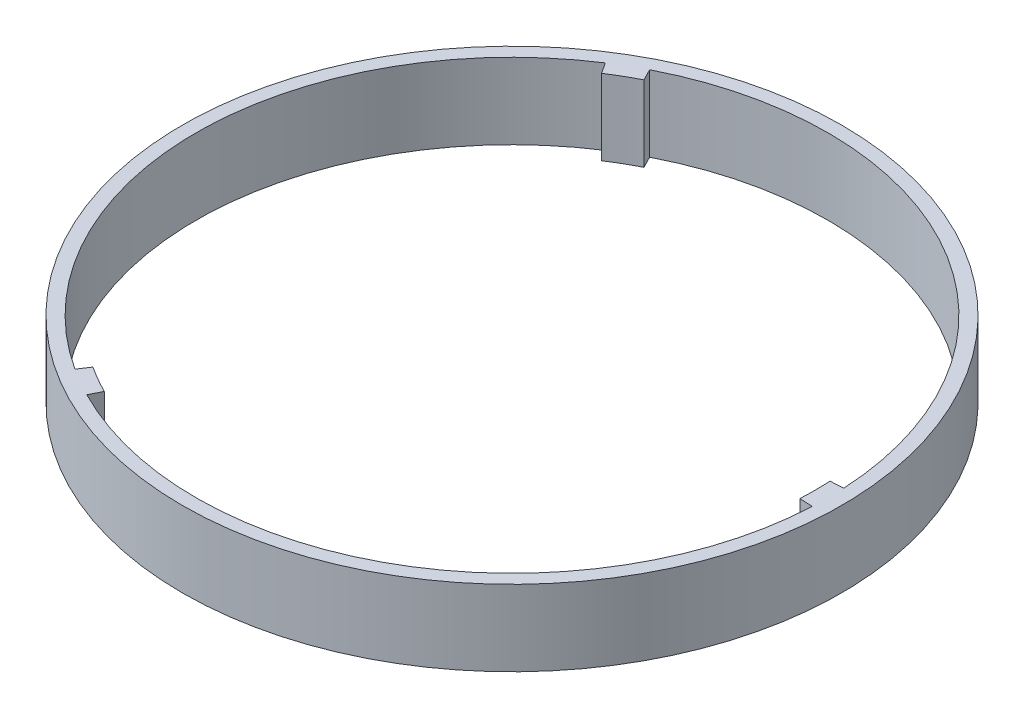
ISO-10303-21;
HEADER;
FILE_DESCRIPTION(('STEP AP214'),'2;1');
FILE_NAME('part.step','',(''),(''),'','','');
FILE_SCHEMA(('AUTOMOTIVE_DESIGN { 1 0 10303 214 1 1 1 1 }'));
ENDSEC;
DATA;
#1=APPLICATION_CONTEXT('core data for automotive mechanical design processes');
#2=APPLICATION_PROTOCOL_DEFINITION('international standard','automotive_design',2000,#1);
#3=PRODUCT_CONTEXT('',#1,'mechanical');
#4=PRODUCT('Part','Part','',(#3));
#5=PRODUCT_RELATED_PRODUCT_CATEGORY('part','',(#4));
#6=PRODUCT_DEFINITION_FORMATION('','',#4);
#7=PRODUCT_DEFINITION_CONTEXT('part definition',#1,'design');
#8=PRODUCT_DEFINITION('design','',#6,#7);
#9=PRODUCT_DEFINITION_SHAPE('','',#8);
#10=(LENGTH_UNIT() NAMED_UNIT(*) SI_UNIT(.MILLI.,.METRE.));
#11=(NAMED_UNIT(*) PLANE_ANGLE_UNIT() SI_UNIT($,.RADIAN.));
#12=(NAMED_UNIT(*) SI_UNIT($,.STERADIAN.) SOLID_ANGLE_UNIT());
#13=UNCERTAINTY_MEASURE_WITH_UNIT(LENGTH_MEASURE(1.E-05),#10,'distance_accuracy_value','');
#14=(GEOMETRIC_REPRESENTATION_CONTEXT(3) GLOBAL_UNCERTAINTY_ASSIGNED_CONTEXT((#13)) GLOBAL_UNIT_ASSIGNED_CONTEXT((#10,
#11,#12)) REPRESENTATION_CONTEXT('',''));
#15=CARTESIAN_POINT('',(0.,0.,0.));
#16=DIRECTION('',(0.,0.,1.));
#17=DIRECTION('',(1.,0.,0.));
#18=AXIS2_PLACEMENT_3D('',#15,#16,#17);
#19=CARTESIAN_POINT('',(-0.0197413031440411,19.05,-0.00227396375139646));
#20=DIRECTION('',(0.,1.,0.));
#21=DIRECTION('',(0.,0.,1.));
#22=AXIS2_PLACEMENT_3D('',#19,#20,#21);
#23=PLANE('',#22);
#24=CARTESIAN_POINT('',(-0.0197413031440411,19.05,-0.00227396375139646));
#25=DIRECTION('',(0.,1.,0.));
#26=DIRECTION('',(0.,0.,1.));
#27=AXIS2_PLACEMENT_3D('',#24,#25,#26);
#28=CIRCLE('',#27,55.245);
#29=CARTESIAN_POINT('',(-0.0197413031440411,19.05,55.2427260362486));
#30=VERTEX_POINT('',#29);
#31=EDGE_CURVE('E195',#30,#30,#28,.T.);
#32=ORIENTED_EDGE('',*,*,#31,.T.);
#33=EDGE_LOOP('',(#32));
#34=FACE_BOUND('',#33,.T.);
#35=CARTESIAN_POINT('',(-0.0197413031440411,19.05,-0.00227396375139646));
#36=DIRECTION('',(0.,1.,0.));
#37=DIRECTION('',(0.,0.,1.));
#38=AXIS2_PLACEMENT_3D('',#35,#36,#37);
#39=CIRCLE('',#38,50.8);
#40=CARTESIAN_POINT('',(-27.636409603673,19.05,42.6352638635969));
#41=VERTEX_POINT('',#40);
#42=CARTESIAN_POINT('',(-23.1365980238422,19.05,45.2332312877069));
#43=VERTEX_POINT('',#42);
#44=EDGE_CURVE('E189',#41,#43,#39,.T.);
#45=ORIENTED_EDGE('',*,*,#44,.F.);
#46=DIRECTION('',(-0.543635202766318,0.,0.839321610774573));
#47=VECTOR('',#46,1.);
#48=CARTESIAN_POINT('',(-27.636409603673,19.05,42.6352638635969));
#49=LINE('',#48,#47);
#50=CARTESIAN_POINT('',(-28.8204739876455,19.05,44.4633478819968));
#51=VERTEX_POINT('',#50);
#52=EDGE_CURVE('E137',#41,#51,#49,.T.);
#53=ORIENTED_EDGE('',*,*,#52,.T.);
#54=CARTESIAN_POINT('',(-0.0197413031440411,19.05,-0.00227396375139646));
#55=DIRECTION('',(0.,1.,0.));
#56=DIRECTION('',(0.,0.,1.));
#57=AXIS2_PLACEMENT_3D('',#54,#55,#56);
#58=CIRCLE('',#57,52.9780495044239);
#59=CARTESIAN_POINT('',(-28.8290868119656,19.05,-44.4623160312813));
#60=VERTEX_POINT('',#59);
#61=EDGE_CURVE('E165',#60,#51,#58,.T.);
#62=ORIENTED_EDGE('',*,*,#61,.F.);
#63=DIRECTION('',(-0.543797776217045,0.,-0.839216288319881));
#64=VECTOR('',#63,1.);
#65=CARTESIAN_POINT('',(-27.6446683349693,19.05,-42.6344614104017));
#66=LINE('',#65,#64);
#67=CARTESIAN_POINT('',(-27.6446683349693,19.05,-42.6344614104017));
#68=VERTEX_POINT('',#67);
#69=EDGE_CURVE('E162',#68,#60,#66,.T.);
#70=ORIENTED_EDGE('',*,*,#69,.F.);
#71=CARTESIAN_POINT('',(-23.1323747405168,19.05,-45.2399372056745));
#72=VERTEX_POINT('',#71);
#73=EDGE_CURVE('E194',#72,#68,#39,.T.);
#74=ORIENTED_EDGE('',*,*,#73,.F.);
#75=DIRECTION('',(-0.454973099160882,0.,-0.890505181927619));
#76=VECTOR('',#75,1.);
#77=CARTESIAN_POINT('',(-23.1323747405168,19.05,-45.2399372056745));
#78=LINE('',#77,#76);
#79=CARTESIAN_POINT('',(-24.1233286736704,19.05,-47.1795015758588));
#80=VERTEX_POINT('',#79);
#81=EDGE_CURVE('E159',#72,#80,#78,.T.);
#82=ORIENTED_EDGE('',*,*,#81,.T.);
#83=CARTESIAN_POINT('',(-0.0197413031440411,19.05,-0.00227396375139646));
#84=DIRECTION('',(0.,1.,0.));
#85=DIRECTION('',(0.,0.,1.));
#86=AXIS2_PLACEMENT_3D('',#83,#84,#85);
#87=CIRCLE('',#86,52.9780495044239);
#88=CARTESIAN_POINT('',(52.8897597651108,19.05,-2.69642058216855));
#89=VERTEX_POINT('',#88);
#90=EDGE_CURVE('E156',#89,#80,#87,.T.);
#91=ORIENTED_EDGE('',*,*,#90,.F.);
#92=DIRECTION('',(0.998706097396747,0.,-0.0508540167790093));
#93=VECTOR('',#92,1.);
#94=CARTESIAN_POINT('',(50.7145284446107,19.05,-2.58565801612506));
#95=LINE('',#94,#93);
#96=CARTESIAN_POINT('',(50.7145284446107,19.05,-2.58565801612506));
#97=VERTEX_POINT('',#96);
#98=EDGE_CURVE('E151',#97,#89,#95,.T.);
#99=ORIENTED_EDGE('',*,*,#98,.F.);
#100=CARTESIAN_POINT('',(50.719529929373,19.05,2.48094064499106));
#101=VERTEX_POINT('',#100);
#102=EDGE_CURVE('E190',#101,#97,#39,.T.);
#103=ORIENTED_EDGE('',*,*,#102,.F.);
#104=DIRECTION('',(0.998804551821201,0.,0.0488821773374496));
#105=VECTOR('',#104,1.);
#106=CARTESIAN_POINT('',(50.719529929373,19.05,2.48094064499106));
#107=LINE('',#106,#105);
#108=CARTESIAN_POINT('',(52.8949756884835,19.05,2.58740844711604));
#109=VERTEX_POINT('',#108);
#110=EDGE_CURVE('E149',#101,#109,#107,.T.);
#111=ORIENTED_EDGE('',*,*,#110,.T.);
#112=CARTESIAN_POINT('',(-0.0197413031440411,19.05,-0.00227396375139646));
#113=DIRECTION('',(0.,1.,0.));
#114=DIRECTION('',(0.,0.,1.));
#115=AXIS2_PLACEMENT_3D('',#112,#113,#114);
#116=CIRCLE('',#115,52.9780495044239);
#117=CARTESIAN_POINT('',(-24.1244359545791,19.05,47.1743879047432));
#118=VERTEX_POINT('',#117);
#119=EDGE_CURVE('E130',#118,#109,#116,.T.);
#120=ORIENTED_EDGE('',*,*,#119,.F.);
#121=DIRECTION('',(-0.453541831837662,0.,0.891234989648262));
#122=VECTOR('',#121,1.);
#123=CARTESIAN_POINT('',(-23.1365980238422,19.05,45.2332312877069));
#124=LINE('',#123,#122);
#125=EDGE_CURVE('E140',#43,#118,#124,.T.);
#126=ORIENTED_EDGE('',*,*,#125,.F.);
#127=EDGE_LOOP('',(#45,#53,#62,#70,#74,#82,#91,#99,#103,#111,#120,#126));
#128=FACE_BOUND('',#127,.T.);
#129=ADVANCED_FACE('F34',(#34,#128),#23,.T.);
#130=CARTESIAN_POINT('',(-0.0197413031440411,6.34999999999999,-0.00227396375139646));
#131=DIRECTION('',(0.,1.,0.));
#132=DIRECTION('',(0.,0.,1.));
#133=AXIS2_PLACEMENT_3D('',#130,#131,#132);
#134=PLANE('',#133);
#135=CARTESIAN_POINT('',(-0.0197413031440411,6.34999999999999,-0.00227396375139646));
#136=DIRECTION('',(0.,1.,0.));
#137=DIRECTION('',(0.,0.,1.));
#138=AXIS2_PLACEMENT_3D('',#135,#136,#137);
#139=CIRCLE('',#138,55.245);
#140=CARTESIAN_POINT('',(-0.0197413031440411,6.34999999999999,55.2427260362486));
#141=VERTEX_POINT('',#140);
#142=EDGE_CURVE('E199',#141,#141,#139,.T.);
#143=ORIENTED_EDGE('',*,*,#142,.F.);
#144=EDGE_LOOP('',(#143));
#145=FACE_BOUND('',#144,.T.);
#146=DIRECTION('',(-0.543635202766318,0.,0.839321610774573));
#147=VECTOR('',#146,1.);
#148=CARTESIAN_POINT('',(-0.019741303144009,6.34999999999999,-0.00227396375137572));
#149=LINE('',#148,#147);
#150=CARTESIAN_POINT('',(-27.636409603673,6.34999999999999,42.6352638635969));
#151=VERTEX_POINT('',#150);
#152=CARTESIAN_POINT('',(-28.8204739876455,6.34999999999999,44.4633478819968));
#153=VERTEX_POINT('',#152);
#154=EDGE_CURVE('E185',#151,#153,#149,.T.);
#155=ORIENTED_EDGE('',*,*,#154,.F.);
#156=CARTESIAN_POINT('',(-0.0197413031440411,6.34999999999999,-0.00227396375139646));
#157=DIRECTION('',(0.,1.,0.));
#158=DIRECTION('',(0.,0.,1.));
#159=AXIS2_PLACEMENT_3D('',#156,#157,#158);
#160=CIRCLE('',#159,50.8);
#161=CARTESIAN_POINT('',(-23.1365980238422,6.34999999999999,45.2332312877069));
#162=VERTEX_POINT('',#161);
#163=EDGE_CURVE('E193',#151,#162,#160,.T.);
#164=ORIENTED_EDGE('',*,*,#163,.T.);
#165=DIRECTION('',(-0.453541831837662,0.,0.891234989648262));
#166=VECTOR('',#165,1.);
#167=CARTESIAN_POINT('',(-0.0967062573885209,6.34999999999999,-0.0414407679509484));
#168=LINE('',#167,#166);
#169=CARTESIAN_POINT('',(-24.1244359545791,6.34999999999999,47.1743879047432));
#170=VERTEX_POINT('',#169);
#171=EDGE_CURVE('E187',#162,#170,#168,.T.);
#172=ORIENTED_EDGE('',*,*,#171,.T.);
#173=CARTESIAN_POINT('',(-0.0197413031440411,6.34999999999999,-0.00227396375139646));
#174=DIRECTION('',(0.,1.,0.));
#175=DIRECTION('',(0.,0.,1.));
#176=AXIS2_PLACEMENT_3D('',#173,#174,#175);
#177=CIRCLE('',#176,52.9780495044239);
#178=CARTESIAN_POINT('',(52.8949756884835,6.34999999999999,2.58740844711604));
#179=VERTEX_POINT('',#178);
#180=EDGE_CURVE('E133',#170,#179,#177,.T.);
#181=ORIENTED_EDGE('',*,*,#180,.T.);
#182=DIRECTION('',(0.998804551821201,0.,0.0488821773374496));
#183=VECTOR('',#182,1.);
#184=CARTESIAN_POINT('',(-0.0197413031440418,6.34999999999999,-0.00227396375138087));
#185=LINE('',#184,#183);
#186=CARTESIAN_POINT('',(50.719529929373,6.34999999999999,2.48094064499106));
#187=VERTEX_POINT('',#186);
#188=EDGE_CURVE('E172',#187,#179,#185,.T.);
#189=ORIENTED_EDGE('',*,*,#188,.F.);
#190=CARTESIAN_POINT('',(50.7145284446107,6.34999999999999,-2.58565801612541));
#191=VERTEX_POINT('',#190);
#192=EDGE_CURVE('E202',#187,#191,#160,.T.);
#193=ORIENTED_EDGE('',*,*,#192,.T.);
#194=DIRECTION('',(0.998706097396747,0.,-0.0508540167790093));
#195=VECTOR('',#194,1.);
#196=CARTESIAN_POINT('',(-0.0197413031440407,6.34999999999999,-0.00227396375138867));
#197=LINE('',#196,#195);
#198=CARTESIAN_POINT('',(52.8897597651108,6.34999999999999,-2.69642058216855));
#199=VERTEX_POINT('',#198);
#200=EDGE_CURVE('E57',#191,#199,#197,.T.);
#201=ORIENTED_EDGE('',*,*,#200,.T.);
#202=CARTESIAN_POINT('',(-0.0197413031440411,6.34999999999999,-0.00227396375139646));
#203=DIRECTION('',(0.,1.,0.));
#204=DIRECTION('',(0.,0.,1.));
#205=AXIS2_PLACEMENT_3D('',#202,#203,#204);
#206=CIRCLE('',#205,52.9780495044239);
#207=CARTESIAN_POINT('',(-24.1233286736704,6.34999999999999,-47.1795015758588));
#208=VERTEX_POINT('',#207);
#209=EDGE_CURVE('E42',#199,#208,#206,.T.);
#210=ORIENTED_EDGE('',*,*,#209,.T.);
#211=DIRECTION('',(-0.454973099160882,0.,-0.89050518192762));
#212=VECTOR('',#211,1.);
#213=CARTESIAN_POINT('',(-0.0197413031440256,6.34999999999999,-0.00227396375140436));
#214=LINE('',#213,#212);
#215=CARTESIAN_POINT('',(-23.1323747405168,6.34999999999999,-45.2399372056745));
#216=VERTEX_POINT('',#215);
#217=EDGE_CURVE('E182',#216,#208,#214,.T.);
#218=ORIENTED_EDGE('',*,*,#217,.F.);
#219=CARTESIAN_POINT('',(-27.6446683349693,6.34999999999999,-42.6344614104017));
#220=VERTEX_POINT('',#219);
#221=EDGE_CURVE('E205',#216,#220,#160,.T.);
#222=ORIENTED_EDGE('',*,*,#221,.T.);
#223=DIRECTION('',(-0.543797776217045,0.,-0.839216288319881));
#224=VECTOR('',#223,1.);
#225=CARTESIAN_POINT('',(-0.019741303143418,6.34999999999999,-0.00227396375180021));
#226=LINE('',#225,#224);
#227=CARTESIAN_POINT('',(-28.8290868119656,6.34999999999999,-44.4623160312813));
#228=VERTEX_POINT('',#227);
#229=EDGE_CURVE('E49',#220,#228,#226,.T.);
#230=ORIENTED_EDGE('',*,*,#229,.T.);
#231=CARTESIAN_POINT('',(-0.0197413031440411,6.34999999999999,-0.00227396375139646));
#232=DIRECTION('',(0.,1.,0.));
#233=DIRECTION('',(0.,0.,1.));
#234=AXIS2_PLACEMENT_3D('',#231,#232,#233);
#235=CIRCLE('',#234,52.9780495044239);
#236=EDGE_CURVE('E11',#228,#153,#235,.T.);
#237=ORIENTED_EDGE('',*,*,#236,.T.);
#238=EDGE_LOOP('',(#155,#164,#172,#181,#189,#193,#201,#210,#218,#222,#230,#237));
#239=FACE_BOUND('',#238,.T.);
#240=ADVANCED_FACE('F220',(#145,#239),#134,.F.);
#241=CARTESIAN_POINT('',(-0.0197413031440411,-13.21,-0.00227396375139646));
#242=DIRECTION('',(0.,1.,0.));
#243=DIRECTION('',(0.,0.,1.));
#244=AXIS2_PLACEMENT_3D('',#241,#242,#243);
#245=CYLINDRICAL_SURFACE('',#244,50.8);
#246=DIRECTION('',(0.,1.,0.));
#247=VECTOR('',#246,1.);
#248=CARTESIAN_POINT('',(-23.1365980238423,-13.21,45.2332312877069));
#249=LINE('',#248,#247);
#250=EDGE_CURVE('E143',#162,#43,#249,.T.);
#251=ORIENTED_EDGE('',*,*,#250,.F.);
#252=ORIENTED_EDGE('',*,*,#163,.F.);
#253=DIRECTION('',(0.,1.,0.));
#254=VECTOR('',#253,1.);
#255=CARTESIAN_POINT('',(-27.636409603673,-13.21,42.6352638635969));
#256=LINE('',#255,#254);
#257=EDGE_CURVE('E213',#41,#151,#256,.F.);
#258=ORIENTED_EDGE('',*,*,#257,.F.);
#259=ORIENTED_EDGE('',*,*,#44,.T.);
#260=EDGE_LOOP('',(#251,#252,#258,#259));
#261=FACE_BOUND('',#260,.T.);
#262=ADVANCED_FACE('F241',(#261),#245,.F.);
#263=DIRECTION('',(0.,1.,0.));
#264=VECTOR('',#263,1.);
#265=CARTESIAN_POINT('',(-27.6446683349693,-13.21,-42.6344614104017));
#266=LINE('',#265,#264);
#267=EDGE_CURVE('E211',#220,#68,#266,.T.);
#268=ORIENTED_EDGE('',*,*,#267,.F.);
#269=ORIENTED_EDGE('',*,*,#221,.F.);
#270=DIRECTION('',(0.,1.,0.));
#271=VECTOR('',#270,1.);
#272=CARTESIAN_POINT('',(-23.1323747405168,-13.21,-45.2399372056745));
#273=LINE('',#272,#271);
#274=EDGE_CURVE('E209',#72,#216,#273,.F.);
#275=ORIENTED_EDGE('',*,*,#274,.F.);
#276=ORIENTED_EDGE('',*,*,#73,.T.);
#277=EDGE_LOOP('',(#268,#269,#275,#276));
#278=FACE_BOUND('',#277,.T.);
#279=ADVANCED_FACE('F236',(#278),#245,.F.);
#280=DIRECTION('',(0.,1.,0.));
#281=VECTOR('',#280,1.);
#282=CARTESIAN_POINT('',(50.7145284446107,-13.21,-2.58565801612541));
#283=LINE('',#282,#281);
#284=EDGE_CURVE('E207',#191,#97,#283,.T.);
#285=ORIENTED_EDGE('',*,*,#284,.F.);
#286=ORIENTED_EDGE('',*,*,#192,.F.);
#287=DIRECTION('',(0.,1.,0.));
#288=VECTOR('',#287,1.);
#289=CARTESIAN_POINT('',(50.719529929373,-13.21,2.48094064499106));
#290=LINE('',#289,#288);
#291=EDGE_CURVE('E198',#101,#187,#290,.F.);
#292=ORIENTED_EDGE('',*,*,#291,.F.);
#293=ORIENTED_EDGE('',*,*,#102,.T.);
#294=EDGE_LOOP('',(#285,#286,#292,#293));
#295=FACE_BOUND('',#294,.T.);
#296=ADVANCED_FACE('F267',(#295),#245,.F.);
#297=CARTESIAN_POINT('',(-0.0197413031440411,19.05,-0.00227396375139646));
#298=DIRECTION('',(0.,-1.,0.));
#299=DIRECTION('',(0.,0.,-1.));
#300=AXIS2_PLACEMENT_3D('',#297,#298,#299);
#301=CYLINDRICAL_SURFACE('',#300,55.245);
#302=ORIENTED_EDGE('',*,*,#31,.F.);
#303=EDGE_LOOP('',(#302));
#304=FACE_BOUND('',#303,.T.);
#305=ORIENTED_EDGE('',*,*,#142,.T.);
#306=EDGE_LOOP('',(#305));
#307=FACE_BOUND('',#306,.T.);
#308=ADVANCED_FACE('F36',(#304,#307),#301,.T.);
#309=CARTESIAN_POINT('',(50.719529929373,-13.21,2.48094064499106));
#310=DIRECTION('',(-0.0488821773374496,0.,0.998804551821201));
#311=DIRECTION('',(0.998804551821201,0.,0.0488821773374496));
#312=AXIS2_PLACEMENT_3D('',#309,#310,#311);
#313=PLANE('',#312);
#314=ORIENTED_EDGE('',*,*,#188,.T.);
#315=DIRECTION('',(0.,1.,0.));
#316=VECTOR('',#315,1.);
#317=CARTESIAN_POINT('',(52.8949756884835,-13.21,2.58740844711604));
#318=LINE('',#317,#316);
#319=EDGE_CURVE('E136',#179,#109,#318,.T.);
#320=ORIENTED_EDGE('',*,*,#319,.T.);
#321=ORIENTED_EDGE('',*,*,#110,.F.);
#322=ORIENTED_EDGE('',*,*,#291,.T.);
#323=EDGE_LOOP('',(#314,#320,#321,#322));
#324=FACE_BOUND('',#323,.T.);
#325=ADVANCED_FACE('F270',(#324),#313,.T.);
#326=CARTESIAN_POINT('',(-23.1365980238422,-13.21,45.2332312877069));
#327=DIRECTION('',(-0.891234989648262,0.,-0.453541831837662));
#328=DIRECTION('',(-0.453541831837662,0.,0.891234989648262));
#329=AXIS2_PLACEMENT_3D('',#326,#327,#328);
#330=PLANE('',#329);
#331=ORIENTED_EDGE('',*,*,#250,.T.);
#332=ORIENTED_EDGE('',*,*,#125,.T.);
#333=DIRECTION('',(0.,1.,0.));
#334=VECTOR('',#333,1.);
#335=CARTESIAN_POINT('',(-24.1244359545791,-13.21,47.1743879047432));
#336=LINE('',#335,#334);
#337=EDGE_CURVE('E125',#170,#118,#336,.T.);
#338=ORIENTED_EDGE('',*,*,#337,.F.);
#339=ORIENTED_EDGE('',*,*,#171,.F.);
#340=EDGE_LOOP('',(#331,#332,#338,#339));
#341=FACE_BOUND('',#340,.T.);
#342=ADVANCED_FACE('F141',(#341),#330,.F.);
#343=CARTESIAN_POINT('',(-0.0197413031440411,-13.21,-0.00227396375139646));
#344=DIRECTION('',(0.,1.,0.));
#345=DIRECTION('',(0.,0.,1.));
#346=AXIS2_PLACEMENT_3D('',#343,#344,#345);
#347=CYLINDRICAL_SURFACE('',#346,52.9780495044239);
#348=ORIENTED_EDGE('',*,*,#337,.T.);
#349=ORIENTED_EDGE('',*,*,#119,.T.);
#350=ORIENTED_EDGE('',*,*,#319,.F.);
#351=ORIENTED_EDGE('',*,*,#180,.F.);
#352=EDGE_LOOP('',(#348,#349,#350,#351));
#353=FACE_BOUND('',#352,.T.);
#354=ADVANCED_FACE('F127',(#353),#347,.F.);
#355=CARTESIAN_POINT('',(-23.1323747405168,-13.21,-45.2399372056745));
#356=DIRECTION('',(0.890505181927619,0.,-0.454973099160882));
#357=DIRECTION('',(-0.454973099160882,0.,-0.89050518192762));
#358=AXIS2_PLACEMENT_3D('',#355,#356,#357);
#359=PLANE('',#358);
#360=ORIENTED_EDGE('',*,*,#217,.T.);
#361=DIRECTION('',(0.,1.,0.));
#362=VECTOR('',#361,1.);
#363=CARTESIAN_POINT('',(-24.1233286736704,-13.21,-47.1795015758588));
#364=LINE('',#363,#362);
#365=EDGE_CURVE('E175',#208,#80,#364,.T.);
#366=ORIENTED_EDGE('',*,*,#365,.T.);
#367=ORIENTED_EDGE('',*,*,#81,.F.);
#368=ORIENTED_EDGE('',*,*,#274,.T.);
#369=EDGE_LOOP('',(#360,#366,#367,#368));
#370=FACE_BOUND('',#369,.T.);
#371=ADVANCED_FACE('F234',(#370),#359,.T.);
#372=CARTESIAN_POINT('',(50.7145284446107,-13.21,-2.58565801612506));
#373=DIRECTION('',(0.0508540167790093,0.,0.998706097396747));
#374=DIRECTION('',(0.998706097396747,0.,-0.0508540167790093));
#375=AXIS2_PLACEMENT_3D('',#372,#373,#374);
#376=PLANE('',#375);
#377=ORIENTED_EDGE('',*,*,#284,.T.);
#378=ORIENTED_EDGE('',*,*,#98,.T.);
#379=DIRECTION('',(0.,1.,0.));
#380=VECTOR('',#379,1.);
#381=CARTESIAN_POINT('',(52.8897597651108,-13.21,-2.69642058216855));
#382=LINE('',#381,#380);
#383=EDGE_CURVE('E177',#199,#89,#382,.T.);
#384=ORIENTED_EDGE('',*,*,#383,.F.);
#385=ORIENTED_EDGE('',*,*,#200,.F.);
#386=EDGE_LOOP('',(#377,#378,#384,#385));
#387=FACE_BOUND('',#386,.T.);
#388=ADVANCED_FACE('F226',(#387),#376,.F.);
#389=CARTESIAN_POINT('',(-0.0197413031440411,-13.21,-0.00227396375139646));
#390=DIRECTION('',(0.,1.,0.));
#391=DIRECTION('',(0.,0.,1.));
#392=AXIS2_PLACEMENT_3D('',#389,#390,#391);
#393=CYLINDRICAL_SURFACE('',#392,52.9780495044239);
#394=ORIENTED_EDGE('',*,*,#383,.T.);
#395=ORIENTED_EDGE('',*,*,#90,.T.);
#396=ORIENTED_EDGE('',*,*,#365,.F.);
#397=ORIENTED_EDGE('',*,*,#209,.F.);
#398=EDGE_LOOP('',(#394,#395,#396,#397));
#399=FACE_BOUND('',#398,.T.);
#400=ADVANCED_FACE('F225',(#399),#393,.F.);
#401=CARTESIAN_POINT('',(-0.0197413031440411,-13.21,-0.00227396375139646));
#402=DIRECTION('',(0.,1.,0.));
#403=DIRECTION('',(0.,0.,1.));
#404=AXIS2_PLACEMENT_3D('',#401,#402,#403);
#405=CYLINDRICAL_SURFACE('',#404,52.9780495044239);
#406=DIRECTION('',(0.,1.,0.));
#407=VECTOR('',#406,1.);
#408=CARTESIAN_POINT('',(-28.8290868119656,-13.21,-44.4623160312813));
#409=LINE('',#408,#407);
#410=EDGE_CURVE('E173',#228,#60,#409,.T.);
#411=ORIENTED_EDGE('',*,*,#410,.T.);
#412=ORIENTED_EDGE('',*,*,#61,.T.);
#413=DIRECTION('',(0.,1.,0.));
#414=VECTOR('',#413,1.);
#415=CARTESIAN_POINT('',(-28.8204739876455,-13.21,44.4633478819968));
#416=LINE('',#415,#414);
#417=EDGE_CURVE('E170',#153,#51,#416,.T.);
#418=ORIENTED_EDGE('',*,*,#417,.F.);
#419=ORIENTED_EDGE('',*,*,#236,.F.);
#420=EDGE_LOOP('',(#411,#412,#418,#419));
#421=FACE_BOUND('',#420,.T.);
#422=ADVANCED_FACE('F247',(#421),#405,.F.);
#423=CARTESIAN_POINT('',(-27.636409603673,-13.21,42.6352638635969));
#424=DIRECTION('',(-0.839321610774573,0.,-0.543635202766318));
#425=DIRECTION('',(-0.543635202766318,0.,0.839321610774573));
#426=AXIS2_PLACEMENT_3D('',#423,#424,#425);
#427=PLANE('',#426);
#428=ORIENTED_EDGE('',*,*,#154,.T.);
#429=ORIENTED_EDGE('',*,*,#417,.T.);
#430=ORIENTED_EDGE('',*,*,#52,.F.);
#431=ORIENTED_EDGE('',*,*,#257,.T.);
#432=EDGE_LOOP('',(#428,#429,#430,#431));
#433=FACE_BOUND('',#432,.T.);
#434=ADVANCED_FACE('F244',(#433),#427,.T.);
#435=CARTESIAN_POINT('',(-27.6446683349693,-13.21,-42.6344614104017));
#436=DIRECTION('',(0.839216288319881,0.,-0.543797776217045));
#437=DIRECTION('',(-0.543797776217045,0.,-0.839216288319881));
#438=AXIS2_PLACEMENT_3D('',#435,#436,#437);
#439=PLANE('',#438);
#440=ORIENTED_EDGE('',*,*,#267,.T.);
#441=ORIENTED_EDGE('',*,*,#69,.T.);
#442=ORIENTED_EDGE('',*,*,#410,.F.);
#443=ORIENTED_EDGE('',*,*,#229,.F.);
#444=EDGE_LOOP('',(#440,#441,#442,#443));
#445=FACE_BOUND('',#444,.T.);
#446=ADVANCED_FACE('F248',(#445),#439,.F.);
#447=CLOSED_SHELL('',(#129,#240,#262,#279,#296,#308,#325,#342,#354,#371,#388,#400,#422,#434,#446));
#448=MANIFOLD_SOLID_BREP('B2',#447);
#449=ADVANCED_BREP_SHAPE_REPRESENTATION('',(#18,#448),#14);
#450=SHAPE_DEFINITION_REPRESENTATION(#9,#449);
ENDSEC;
END-ISO-10303-21;
